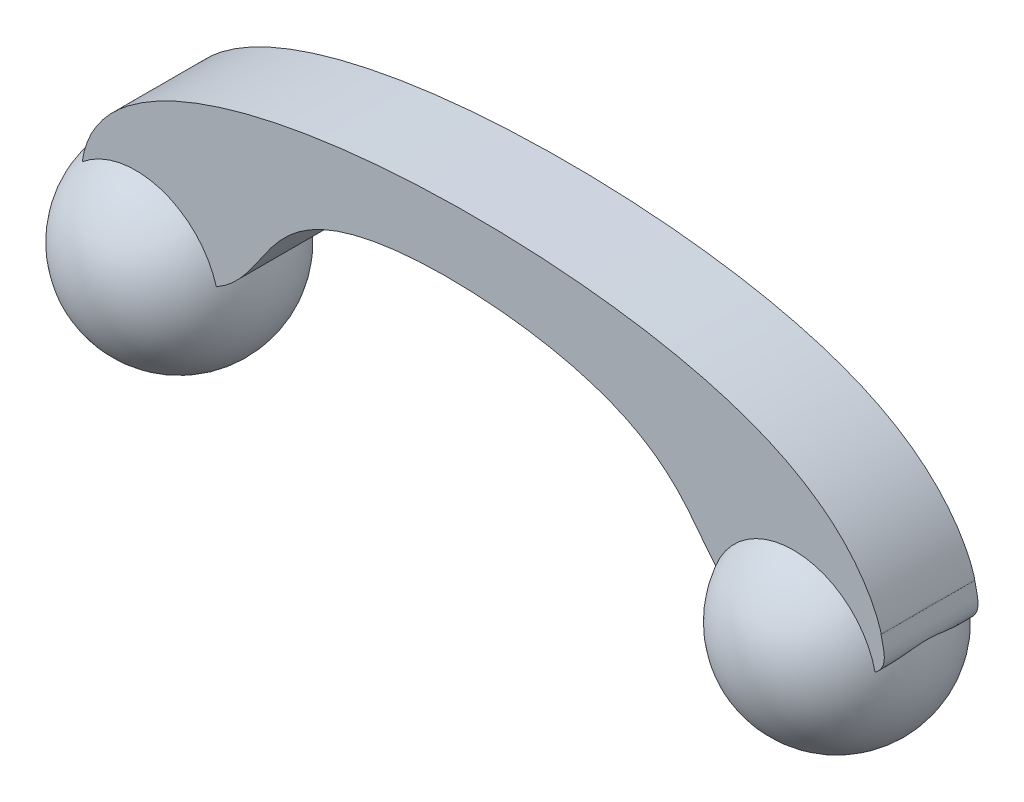
ISO-10303-21;
HEADER;
FILE_DESCRIPTION(('STEP AP214'),'2;1');
FILE_NAME('part.step','',(''),(''),'','','');
FILE_SCHEMA(('AUTOMOTIVE_DESIGN { 1 0 10303 214 1 1 1 1 }'));
ENDSEC;
DATA;
#1=APPLICATION_CONTEXT('core data for automotive mechanical design processes');
#2=APPLICATION_PROTOCOL_DEFINITION('international standard','automotive_design',2000,#1);
#3=PRODUCT_CONTEXT('',#1,'mechanical');
#4=PRODUCT('Part','Part','',(#3));
#5=PRODUCT_RELATED_PRODUCT_CATEGORY('part','',(#4));
#6=PRODUCT_DEFINITION_FORMATION('','',#4);
#7=PRODUCT_DEFINITION_CONTEXT('part definition',#1,'design');
#8=PRODUCT_DEFINITION('design','',#6,#7);
#9=PRODUCT_DEFINITION_SHAPE('','',#8);
#10=(LENGTH_UNIT() NAMED_UNIT(*) SI_UNIT(.MILLI.,.METRE.));
#11=(NAMED_UNIT(*) PLANE_ANGLE_UNIT() SI_UNIT($,.RADIAN.));
#12=(NAMED_UNIT(*) SI_UNIT($,.STERADIAN.) SOLID_ANGLE_UNIT());
#13=UNCERTAINTY_MEASURE_WITH_UNIT(LENGTH_MEASURE(1.E-05),#10,'distance_accuracy_value','');
#14=(GEOMETRIC_REPRESENTATION_CONTEXT(3) GLOBAL_UNCERTAINTY_ASSIGNED_CONTEXT((#13)) GLOBAL_UNIT_ASSIGNED_CONTEXT((#10,
#11,#12)) REPRESENTATION_CONTEXT('',''));
#15=CARTESIAN_POINT('',(0.,0.,0.));
#16=DIRECTION('',(0.,0.,1.));
#17=DIRECTION('',(1.,0.,0.));
#18=AXIS2_PLACEMENT_3D('',#15,#16,#17);
#19=CARTESIAN_POINT('',(-81.62925333054,0.,20.));
#20=CARTESIAN_POINT('',(-83.3967289414946,-13.8452256191448,20.));
#21=CARTESIAN_POINT('',(-61.221939997905,-15.9253333016357,20.));
#22=CARTESIAN_POINT('',(-49.5878641727579,-13.4459400929978,20.));
#23=CARTESIAN_POINT('',(-35.474395138973,-11.3479919933812,20.));
#24=CARTESIAN_POINT('',(-35.474395138973,2.5747544858932,20.));
#25=CARTESIAN_POINT('',(-37.5723432385897,13.6366626475084,20.));
#26=CARTESIAN_POINT('',(-90.5932133925385,42.6264909331208,20.));
#27=CARTESIAN_POINT('',(6.86601196238187,15.3531656381039,20.));
#28=CARTESIAN_POINT('',(21.5516486596987,15.3531656381039,20.));
#29=CARTESIAN_POINT('',(23.6495967593153,18.0232814012524,20.));
#30=CARTESIAN_POINT('',(59.6961595618201,30.6109699989525,20.));
#31=CARTESIAN_POINT('',(54.3559280355231,3.71908981295684,20.));
#32=CARTESIAN_POINT('',(59.6961595618201,-5.05414769453111,20.));
#33=CARTESIAN_POINT('',(52.2579799359064,-14.0181077565297,20.));
#34=CARTESIAN_POINT('',(13.3505788157425,-27.1779640177616,20.));
#35=CARTESIAN_POINT('',(84.6808142027097,-13.6366626475084,20.));
#36=CARTESIAN_POINT('',(87.9230976293901,-13.6366626475084,20.));
#37=CARTESIAN_POINT('',(91.1653810560704,-12.1108822114236,20.));
#38=CARTESIAN_POINT('',(91.1653810560704,-9.44076644827507,20.));
#39=CARTESIAN_POINT('',(89.0674329564537,-3.52836725844624,20.));
#40=CARTESIAN_POINT('',(88.8767104019431,-2.00258682236139,20.));
#41=B_SPLINE_CURVE_WITH_KNOTS('',21,(#19,#20,#21,#22,#23,#24,#25,#26,#27,#28,#29,#30,#31,#32,
#33,#34,#35,#36,#37,#38,#39,#40),.UNSPECIFIED.,.F.,.F.,(22,22),(0.,1.),.UNSPECIFIED.);
#42=DIRECTION('',(0.,0.,-1.));
#43=VECTOR('',#42,1.);
#44=SURFACE_OF_LINEAR_EXTRUSION('',#41,#43);
#45=CARTESIAN_POINT('',(-53.7263552662011,-9.0962425035575,0.));
#46=CARTESIAN_POINT('',(-53.5476289608169,-9.00462372453353,0.313394893814392));
#47=CARTESIAN_POINT('',(-53.377769210423,-8.91408495553011,0.632153101416802));
#48=CARTESIAN_POINT('',(-53.055775573976,-8.73679618468713,1.27956575111107));
#49=CARTESIAN_POINT('',(-52.9036434106797,-8.65004655158494,1.60822115110754));
#50=CARTESIAN_POINT('',(-52.6171262572083,-8.48197961610113,2.27455091661191));
#51=CARTESIAN_POINT('',(-52.4827420300889,-8.40066254736167,2.61222566914838));
#52=CARTESIAN_POINT('',(-52.2316065044136,-8.2449579656106,3.29590864428812));
#53=CARTESIAN_POINT('',(-52.1148672633518,-8.17057520425917,3.64192237970383));
#54=CARTESIAN_POINT('',(-51.8990892661429,-8.0302452632447,4.34108333135716));
#55=CARTESIAN_POINT('',(-51.8000493597978,-7.96429753550697,4.69423008239173));
#56=CARTESIAN_POINT('',(-51.6196081044879,-7.84212420379973,5.4066551077774));
#57=CARTESIAN_POINT('',(-51.5382064310637,-7.78589842099657,5.76593326920857));
#58=CARTESIAN_POINT('',(-51.392861783448,-7.68419181272662,6.49017867371506));
#59=CARTESIAN_POINT('',(-51.3289496477927,-7.63872998564694,6.85515478151343));
#60=CARTESIAN_POINT('',(-51.218728811018,-7.55958862634824,7.58904014770847));
#61=CARTESIAN_POINT('',(-51.172420813032,-7.52590956475327,7.95794956260195));
#62=CARTESIAN_POINT('',(-51.0973806044885,-7.47101678254523,8.69847916610874));
#63=CARTESIAN_POINT('',(-51.0686485083896,-7.44980314311008,9.07009937235946));
#64=CARTESIAN_POINT('',(-51.028754217793,-7.4202816657393,9.81454649605831));
#65=CARTESIAN_POINT('',(-51.0175804485305,-7.41196532571932,10.1873724560564));
#66=CARTESIAN_POINT('',(-51.0127598933135,-7.40838274718621,10.9332032421124));
#67=CARTESIAN_POINT('',(-51.0191129705515,-7.41311640681001,11.3062080667514));
#68=CARTESIAN_POINT('',(-51.0493455980868,-7.43552930609273,12.0510629979309));
#69=CARTESIAN_POINT('',(-51.0732236718583,-7.45320745514505,12.422913199101));
#70=CARTESIAN_POINT('',(-51.1532297505971,-7.51197027674162,13.3311782955768));
#71=CARTESIAN_POINT('',(-51.2190358162162,-7.5600086877726,13.8663333795222));
#72=CARTESIAN_POINT('',(-51.3876489528189,-7.6805943558271,14.9279976164206));
#73=CARTESIAN_POINT('',(-51.490460888081,-7.75314483479021,15.4545056232308));
#74=CARTESIAN_POINT('',(-51.7330757273395,-7.91960310307996,16.4947961346253));
#75=CARTESIAN_POINT('',(-51.87283565328,-8.01348606066676,17.008592670749));
#76=CARTESIAN_POINT('',(-52.1895216440249,-8.2187599005225,18.0207670892066));
#77=CARTESIAN_POINT('',(-52.3664275639943,-8.33014128491902,18.5191531614782));
#78=CARTESIAN_POINT('',(-52.6289024613263,-8.48836860958659,19.1759479323441));
#79=CARTESIAN_POINT('',(-52.6980546111559,-8.52949960200471,19.342451223435));
#80=CARTESIAN_POINT('',(-52.8406449197818,-8.61303747572806,19.6730164356026));
#81=CARTESIAN_POINT('',(-52.914077358859,-8.65544261925381,19.8370812630203));
#82=CARTESIAN_POINT('',(-52.9897008912071,-8.69841717998982,20.));
#83=B_SPLINE_CURVE_WITH_KNOTS('',3,(#45,#46,#47,#48,#49,#50,#51,#52,#53,#54,#55,#56,#57,#58,#59,
#60,#61,#62,#63,#64,#65,#66,#67,#68,#69,#70,#71,#72,#73,#74,#75,#76,#77,#78,#79,#80,#81,#82),
.UNSPECIFIED.,.F.,.F.,(4,2,2,2,2,2,2,2,2,2,2,2,2,2,2,2,2,2,4),(0.,1.11652823374394,
2.23316488074806,3.3498495208641,4.46729381762675,5.58466547041152,6.70201656713128,
7.82132532797799,8.94067879085188,10.0600395431518,11.1786620826914,12.297275890737,
13.4157954635278,15.0377425822736,16.6599029776,18.2801847087055,19.8995899955304,
20.4543127292331,21.0083104680987),.UNSPECIFIED.);
#84=CARTESIAN_POINT('',(-53.726355266201,-9.09624250355747,0.));
#85=VERTEX_POINT('',#84);
#86=CARTESIAN_POINT('',(-52.9897008912071,-8.69841717998978,20.));
#87=VERTEX_POINT('',#86);
#88=EDGE_CURVE('E101',#85,#87,#83,.T.);
#89=ORIENTED_EDGE('',*,*,#88,.F.);
#90=CARTESIAN_POINT('',(-81.62925333054,0.,0.));
#91=CARTESIAN_POINT('',(-83.3967289414946,-13.8452256191448,0.));
#92=CARTESIAN_POINT('',(-61.221939997905,-15.9253333016357,0.));
#93=CARTESIAN_POINT('',(-49.5878641727579,-13.4459400929978,0.));
#94=CARTESIAN_POINT('',(-35.474395138973,-11.3479919933812,0.));
#95=CARTESIAN_POINT('',(-35.474395138973,2.5747544858932,0.));
#96=CARTESIAN_POINT('',(-37.5723432385897,13.6366626475084,0.));
#97=CARTESIAN_POINT('',(-90.5932133925385,42.6264909331208,0.));
#98=CARTESIAN_POINT('',(6.86601196238187,15.3531656381039,0.));
#99=CARTESIAN_POINT('',(21.5516486596987,15.3531656381039,0.));
#100=CARTESIAN_POINT('',(23.6495967593153,18.0232814012524,0.));
#101=CARTESIAN_POINT('',(59.6961595618201,30.6109699989525,0.));
#102=CARTESIAN_POINT('',(54.3559280355231,3.71908981295684,0.));
#103=CARTESIAN_POINT('',(59.6961595618201,-5.05414769453111,0.));
#104=CARTESIAN_POINT('',(52.2579799359064,-14.0181077565297,0.));
#105=CARTESIAN_POINT('',(13.3505788157425,-27.1779640177616,0.));
#106=CARTESIAN_POINT('',(84.6808142027097,-13.6366626475084,0.));
#107=CARTESIAN_POINT('',(87.9230976293901,-13.6366626475084,0.));
#108=CARTESIAN_POINT('',(91.1653810560704,-12.1108822114236,0.));
#109=CARTESIAN_POINT('',(91.1653810560704,-9.44076644827507,0.));
#110=CARTESIAN_POINT('',(89.0674329564537,-3.52836725844624,0.));
#111=CARTESIAN_POINT('',(88.8767104019431,-2.00258682236139,0.));
#112=B_SPLINE_CURVE_WITH_KNOTS('',21,(#90,#91,#92,#93,#94,#95,#96,#97,#98,#99,#100,#101,#102,
#103,#104,#105,#106,#107,#108,#109,#110,#111),.UNSPECIFIED.,.F.,.F.,(22,22),(0.,1.),.UNSPECIFIED.);
#113=CARTESIAN_POINT('',(54.2028493430971,-7.63417032790614,0.));
#114=VERTEX_POINT('',#113);
#115=EDGE_CURVE('E88',#85,#114,#112,.T.);
#116=ORIENTED_EDGE('',*,*,#115,.T.);
#117=CARTESIAN_POINT('',(53.5856071759249,-6.96784430969093,20.));
#118=CARTESIAN_POINT('',(53.469634069677,-6.83849519176025,19.6996840338178));
#119=CARTESIAN_POINT('',(53.3600104723952,-6.71407446846438,19.3947754285229));
#120=CARTESIAN_POINT('',(53.1532819946661,-6.47624851917929,18.7764213005906));
#121=CARTESIAN_POINT('',(53.0561809071532,-6.36284663323062,18.4629732260972));
#122=CARTESIAN_POINT('',(52.8743804544795,-6.14828889170922,17.8283478628862));
#123=CARTESIAN_POINT('',(52.7896819908834,-6.04713392647539,17.507170014254));
#124=CARTESIAN_POINT('',(52.6325928207296,-5.85798498232312,16.8578314367759));
#125=CARTESIAN_POINT('',(52.5602077423424,-5.76999702394498,16.5296675914819));
#126=CARTESIAN_POINT('',(52.4277743490811,-5.60802792304518,15.8674762245094));
#127=CARTESIAN_POINT('',(52.3677246866703,-5.53404525063731,15.5334493476479));
#128=CARTESIAN_POINT('',(52.2599653445089,-5.40068886960523,14.8605590544671));
#129=CARTESIAN_POINT('',(52.2122551553056,-5.34131455785887,14.5216958384327));
#130=CARTESIAN_POINT('',(52.1083078357864,-5.21156939029736,13.6687592535549));
#131=CARTESIAN_POINT('',(52.0598412757727,-5.15067532655809,13.1522424185266));
#132=CARTESIAN_POINT('',(51.990931129746,-5.06396031806925,12.1144297004487));
#133=CARTESIAN_POINT('',(51.9704892077678,-5.03814145600059,11.5931335354641));
#134=CARTESIAN_POINT('',(51.9576841216393,-5.02197736865793,10.5500445106974));
#135=CARTESIAN_POINT('',(51.965298910047,-5.03160428947832,10.0282523629106));
#136=CARTESIAN_POINT('',(52.0085387691476,-5.08612467034137,8.98771269870832));
#137=CARTESIAN_POINT('',(52.0441622331853,-5.13101610751357,8.46896500937373));
#138=CARTESIAN_POINT('',(52.1421386841587,-5.25384814652041,7.45072436520295));
#139=CARTESIAN_POINT('',(52.2038289105206,-5.33096880369886,6.95106824122812));
#140=CARTESIAN_POINT('',(52.3537196064122,-5.51686872097886,5.96169274380444));
#141=CARTESIAN_POINT('',(52.4419219286569,-5.62565019358059,5.47197406735702));
#142=CARTESIAN_POINT('',(52.6447910658831,-5.87291935296721,4.50580134392724));
#143=CARTESIAN_POINT('',(52.7594537698266,-6.01140242490395,4.02934524926628));
#144=CARTESIAN_POINT('',(53.0153466465169,-6.31532416607947,3.09263681253161));
#145=CARTESIAN_POINT('',(53.156567980349,-6.48075386483018,2.63237913982483));
#146=CARTESIAN_POINT('',(53.4408613519539,-6.80620455948879,1.80364572121603));
#147=CARTESIAN_POINT('',(53.5799042045542,-6.96273678034986,1.43240826817201));
#148=CARTESIAN_POINT('',(53.802787410223,-7.20763291645802,0.886628491250263));
#149=CARTESIAN_POINT('',(53.8793673037987,-7.29084146956109,0.706758342126987));
#150=CARTESIAN_POINT('',(54.0374189332409,-7.46030917060489,0.350639588295184));
#151=CARTESIAN_POINT('',(54.118890686266,-7.54656832924551,0.17439099629256));
#152=CARTESIAN_POINT('',(54.2028493430971,-7.63417032790615,0.));
#153=B_SPLINE_CURVE_WITH_KNOTS('',3,(#117,#118,#119,#120,#121,#122,#123,#124,#125,#126,#127,
#128,#129,#130,#131,#132,#133,#134,#135,#136,#137,#138,#139,#140,#141,#142,#143,#144,#145,#146,
#147,#148,#149,#150,#151,#152),.UNSPECIFIED.,.F.,.F.,(4,2,2,2,2,2,2,2,2,2,2,2,2,2,2,2,2,4),(0.,
1.04073486341316,2.08178421762401,3.12290920969494,4.16450880525206,5.20599455454146,
6.24743729773478,7.81242257552839,9.37750077431353,10.9413493703196,12.505108266183,
14.0312966504442,15.5575917124115,17.0836497998021,18.6092008993202,19.8868716743362,
20.5241710114378,21.1614725840642),.UNSPECIFIED.);
#154=CARTESIAN_POINT('',(53.5856071759249,-6.96784430969092,20.));
#155=VERTEX_POINT('',#154);
#156=EDGE_CURVE('E143',#155,#114,#153,.T.);
#157=ORIENTED_EDGE('',*,*,#156,.F.);
#158=EDGE_CURVE('E102',#87,#155,#41,.T.);
#159=ORIENTED_EDGE('',*,*,#158,.F.);
#160=EDGE_LOOP('',(#89,#116,#157,#159));
#161=FACE_BOUND('',#160,.T.);
#162=ADVANCED_FACE('F33',(#161),#44,.F.);
#163=CARTESIAN_POINT('',(-81.62925333054,0.,1.287130996694));
#164=CARTESIAN_POINT('',(-81.6364493118751,-0.0563670296021964,1.21425267278646));
#165=CARTESIAN_POINT('',(-81.6431606208709,-0.113102624184991,1.14161117110302));
#166=CARTESIAN_POINT('',(-81.6555516290833,-0.227244830745067,0.996820014760496));
#167=CARTESIAN_POINT('',(-81.6612317739163,-0.284651141402734,0.924670160672648));
#168=CARTESIAN_POINT('',(-81.6715033712094,-0.400104593168121,0.780833557534377));
#169=CARTESIAN_POINT('',(-81.6760950681627,-0.458151587290214,0.709146708007301));
#170=CARTESIAN_POINT('',(-81.6841334415156,-0.574858086309905,0.566207268343977));
#171=CARTESIAN_POINT('',(-81.687580105267,-0.633517597966055,0.494954683013191));
#172=CARTESIAN_POINT('',(-81.6932720021528,-0.751419173237653,0.352858806150764));
#173=CARTESIAN_POINT('',(-81.6955169782172,-0.81066135874298,0.28201560540018));
#174=CARTESIAN_POINT('',(-81.6987499028753,-0.929700100262917,0.140713552308141));
#175=CARTESIAN_POINT('',(-81.699737288932,-0.989496892322533,0.070254885995635));
#176=CARTESIAN_POINT('',(-81.700067601925,-1.04953655837465,0.));
#177=B_SPLINE_CURVE_WITH_KNOTS('',3,(#163,#164,#165,#166,#167,#168,#169,#170,#171,#172,#173,
#174,#175,#176),.UNSPECIFIED.,.F.,.F.,(4,2,2,2,2,2,4),(0.,0.277238959804898,0.554357824408045,
0.831414381919361,1.10847399972493,1.3855928636224,1.66283564304421),.UNSPECIFIED.);
#178=CARTESIAN_POINT('',(-81.62925333054,0.,1.287130996694));
#179=VERTEX_POINT('',#178);
#180=CARTESIAN_POINT('',(-81.700067601925,-1.04953655837471,0.));
#181=VERTEX_POINT('',#180);
#182=EDGE_CURVE('E50',#179,#181,#177,.T.);
#183=ORIENTED_EDGE('',*,*,#182,.F.);
#184=DIRECTION('',(0.,0.,-1.));
#185=VECTOR('',#184,1.);
#186=CARTESIAN_POINT('',(-81.62925333054,0.,20.));
#187=LINE('',#186,#185);
#188=CARTESIAN_POINT('',(-81.62925333054,0.,0.));
#189=VERTEX_POINT('',#188);
#190=EDGE_CURVE('E176',#179,#189,#187,.T.);
#191=ORIENTED_EDGE('',*,*,#190,.T.);
#192=EDGE_CURVE('E96',#189,#181,#112,.T.);
#193=ORIENTED_EDGE('',*,*,#192,.T.);
#194=EDGE_LOOP('',(#183,#191,#193));
#195=FACE_BOUND('',#194,.T.);
#196=ADVANCED_FACE('F193',(#195),#44,.F.);
#197=CARTESIAN_POINT('',(-81.62925333054,0.,20.));
#198=CARTESIAN_POINT('',(-78.7684150128809,22.4099001549964,20.));
#199=CARTESIAN_POINT('',(-45.5826905280352,37.8584270703556,20.));
#200=CARTESIAN_POINT('',(9.726850280041,37.8584270703556,20.));
#201=CARTESIAN_POINT('',(57.4074889076928,30.9924151079737,20.));
#202=CARTESIAN_POINT('',(68.6601196238187,26.9872414632509,20.));
#203=CARTESIAN_POINT('',(85.0622593117309,15.7346107471251,20.));
#204=CARTESIAN_POINT('',(89.0674329564537,-1.81186426785078,20.));
#205=CARTESIAN_POINT('',(88.8767104019431,-2.00258682236139,20.));
#206=B_SPLINE_CURVE_WITH_KNOTS('',8,(#197,#198,#199,#200,#201,#202,#203,#204,#205),
.UNSPECIFIED.,.F.,.F.,(9,9),(0.,1.),.UNSPECIFIED.);
#207=DIRECTION('',(0.,0.,-1.));
#208=VECTOR('',#207,1.);
#209=SURFACE_OF_LINEAR_EXTRUSION('',#206,#208);
#210=ORIENTED_EDGE('',*,*,#190,.F.);
#211=CARTESIAN_POINT('',(-81.62925333054,0.,1.287130996694));
#212=CARTESIAN_POINT('',(-81.6070223154293,0.174217880999733,1.51238290936692));
#213=CARTESIAN_POINT('',(-81.5829221301639,0.343532086148693,1.74126752491105));
#214=CARTESIAN_POINT('',(-81.5318959446768,0.671713223623589,2.20643604405884));
#215=CARTESIAN_POINT('',(-81.5049672117157,0.83056980704181,2.44272694558641));
#216=CARTESIAN_POINT('',(-81.4492349995095,1.13689942479684,2.92247516651305));
#217=CARTESIAN_POINT('',(-81.4204309527418,1.28436898330708,3.16593464300058));
#218=CARTESIAN_POINT('',(-81.3616482752989,1.56852983693628,3.66241275422948));
#219=CARTESIAN_POINT('',(-81.3316604202883,1.70509006178039,3.91550544023556));
#220=CARTESIAN_POINT('',(-81.2718750042721,1.96474157920912,4.42845626400614));
#221=CARTESIAN_POINT('',(-81.2420773941242,2.08783649452887,4.68831255866872));
#222=CARTESIAN_POINT('',(-81.1837419783671,2.31969109495482,5.21448278227997));
#223=CARTESIAN_POINT('',(-81.1552041207869,2.42845137180302,5.48079644412718));
#224=CARTESIAN_POINT('',(-81.1002511764019,2.63146579913568,6.02130273307617));
#225=CARTESIAN_POINT('',(-81.073852572297,2.72561164854338,6.29553783124467));
#226=CARTESIAN_POINT('',(-81.024428580845,2.8975976300289,6.84941623564626));
#227=CARTESIAN_POINT('',(-81.0014035120527,2.9754362225495,7.12906004979271));
#228=CARTESIAN_POINT('',(-80.9596549645693,3.1140019284154,7.69288995004339));
#229=CARTESIAN_POINT('',(-80.9409315348971,3.17472884676812,7.97707608786975));
#230=CARTESIAN_POINT('',(-80.9086624923935,3.27807933381464,8.54721782195927));
#231=CARTESIAN_POINT('',(-80.8950858628872,3.3208115247445,8.83315191359724));
#232=CARTESIAN_POINT('',(-80.8735215296445,3.38820808515582,9.40736379094837));
#233=CARTESIAN_POINT('',(-80.8655338342639,3.41287242762466,9.69564158016484));
#234=CARTESIAN_POINT('',(-80.8554873411227,3.44383399601045,10.2732190820583));
#235=CARTESIAN_POINT('',(-80.8534274445625,3.45013462589853,10.5625185953889));
#236=CARTESIAN_POINT('',(-80.8556494222692,3.44332425464167,11.2359995379));
#237=CARTESIAN_POINT('',(-80.8622373357558,3.42315515024412,11.6201247835013));
#238=CARTESIAN_POINT('',(-80.8855692737159,3.35067396402605,12.3849474550041));
#239=CARTESIAN_POINT('',(-80.9023126990678,3.29836377835706,12.7656450817726));
#240=CARTESIAN_POINT('',(-80.9448128705967,3.16234748089727,13.5228875199754));
#241=CARTESIAN_POINT('',(-80.9706158282004,3.07848024062402,13.8994006307208));
#242=CARTESIAN_POINT('',(-81.0293485618194,2.88098870723749,14.6439536022415));
#243=CARTESIAN_POINT('',(-81.0622785484244,2.76736353481546,15.0119932122862));
#244=CARTESIAN_POINT('',(-81.1247820614385,2.54186813498418,15.6537348378747));
#245=CARTESIAN_POINT('',(-81.1533682116797,2.43567937543594,15.9295544648912));
#246=CARTESIAN_POINT('',(-81.212265859912,2.20782735928886,16.4746028601664));
#247=CARTESIAN_POINT('',(-81.2425777096583,2.08616094154147,16.7438302686013));
#248=CARTESIAN_POINT('',(-81.3037681868996,1.82830420949813,17.2752817085849));
#249=CARTESIAN_POINT('',(-81.3346470287708,1.69210830401736,17.5375029951727));
#250=CARTESIAN_POINT('',(-81.3955286272058,1.40746594039961,18.0522514388022));
#251=CARTESIAN_POINT('',(-81.425536710409,1.25913820262823,18.3048437253454));
#252=CARTESIAN_POINT('',(-81.483839668852,0.950198804650387,18.8024433818916));
#253=CARTESIAN_POINT('',(-81.5121352504134,0.78959227155449,19.0474538583535));
#254=CARTESIAN_POINT('',(-81.5659541528162,0.457132602174179,19.5295837312267));
#255=CARTESIAN_POINT('',(-81.5914809019825,0.285293806184723,19.7667126280858));
#256=CARTESIAN_POINT('',(-81.6151243411527,0.108181645448751,20.));
#257=B_SPLINE_CURVE_WITH_KNOTS('',3,(#211,#212,#213,#214,#215,#216,#217,#218,#219,#220,#221,
#222,#223,#224,#225,#226,#227,#228,#229,#230,#231,#232,#233,#234,#235,#236,#237,#238,#239,#240,
#241,#242,#243,#244,#245,#246,#247,#248,#249,#250,#251,#252,#253,#254,#255,#256),.UNSPECIFIED.,
.F.,.F.,(4,2,2,2,2,2,2,2,2,2,2,2,2,2,2,2,2,2,2,2,2,2,4),(0.,0.856848392526042,1.71453236030208,
2.57247710485333,3.43953154817476,4.30635214061859,5.17313693900135,6.04606645673406,
6.91907835005796,7.79210019120792,8.65977389712368,9.52744890026648,10.3949630574728,
11.5475096632894,12.6999882815609,13.85843304839,15.0169120496396,15.9072416874889,
16.7977534586047,17.6886091578672,18.5716029208609,19.4542299754855,20.335751390311),.UNSPECIFIED.);
#258=CARTESIAN_POINT('',(-81.6151243411527,0.108181645448733,20.));
#259=VERTEX_POINT('',#258);
#260=EDGE_CURVE('E57',#179,#259,#257,.T.);
#261=ORIENTED_EDGE('',*,*,#260,.T.);
#262=CARTESIAN_POINT('',(88.8767104019431,-2.00258682236139,20.));
#263=VERTEX_POINT('',#262);
#264=EDGE_CURVE('E151',#259,#263,#206,.T.);
#265=ORIENTED_EDGE('',*,*,#264,.T.);
#266=DIRECTION('',(0.,0.,-1.));
#267=VECTOR('',#266,1.);
#268=CARTESIAN_POINT('',(88.8767104019431,-2.00258682236139,20.));
#269=LINE('',#268,#267);
#270=CARTESIAN_POINT('',(88.8767104019431,-2.00258682236139,0.));
#271=VERTEX_POINT('',#270);
#272=EDGE_CURVE('E163',#263,#271,#269,.T.);
#273=ORIENTED_EDGE('',*,*,#272,.T.);
#274=CARTESIAN_POINT('',(-81.62925333054,0.,0.));
#275=CARTESIAN_POINT('',(-78.7684150128809,22.4099001549964,0.));
#276=CARTESIAN_POINT('',(-45.5826905280352,37.8584270703556,0.));
#277=CARTESIAN_POINT('',(9.726850280041,37.8584270703556,0.));
#278=CARTESIAN_POINT('',(57.4074889076928,30.9924151079737,0.));
#279=CARTESIAN_POINT('',(68.6601196238187,26.9872414632509,0.));
#280=CARTESIAN_POINT('',(85.0622593117309,15.7346107471251,0.));
#281=CARTESIAN_POINT('',(89.0674329564537,-1.81186426785078,0.));
#282=CARTESIAN_POINT('',(88.8767104019431,-2.00258682236139,0.));
#283=B_SPLINE_CURVE_WITH_KNOTS('',8,(#274,#275,#276,#277,#278,#279,#280,#281,#282),
.UNSPECIFIED.,.F.,.F.,(9,9),(0.,1.),.UNSPECIFIED.);
#284=EDGE_CURVE('E150',#189,#271,#283,.T.);
#285=ORIENTED_EDGE('',*,*,#284,.F.);
#286=EDGE_LOOP('',(#210,#261,#265,#273,#285));
#287=FACE_BOUND('',#286,.T.);
#288=ADVANCED_FACE('F35',(#287),#209,.T.);
#289=CARTESIAN_POINT('',(86.8855693079469,-10.1269142874137,0.));
#290=CARTESIAN_POINT('',(87.0126843885355,-10.0494178192095,0.22366990009913));
#291=CARTESIAN_POINT('',(87.1348064089845,-9.97118048508058,0.44991776421739));
#292=CARTESIAN_POINT('',(87.3688589957721,-9.8135450509259,0.907089017885035));
#293=CARTESIAN_POINT('',(87.4807941287531,-9.73414748972506,1.13801025510744));
#294=CARTESIAN_POINT('',(87.6943576082527,-9.57446077431987,1.60419591774061));
#295=CARTESIAN_POINT('',(87.7959883428283,-9.49417183150181,1.83945932184087));
#296=CARTESIAN_POINT('',(87.9888839507518,-9.3330988916756,2.31401522738299));
#297=CARTESIAN_POINT('',(88.0801493208668,-9.25231491858784,2.55330753510524));
#298=CARTESIAN_POINT('',(88.2537796308499,-9.08941052530465,3.03974511786982));
#299=CARTESIAN_POINT('',(88.3359651736283,-9.00729093487876,3.28695469264639));
#300=CARTESIAN_POINT('',(88.4896828291429,-8.84387525590315,3.784945633061));
#301=CARTESIAN_POINT('',(88.5612143944113,-8.76257920987219,4.03572718152426));
#302=CARTESIAN_POINT('',(88.6938134550283,-8.60185346010947,4.54063364020589));
#303=CARTESIAN_POINT('',(88.7548808340851,-8.52242377712763,4.79475858754667));
#304=CARTESIAN_POINT('',(88.8668757527102,-8.36679720613511,5.30619626324731));
#305=CARTESIAN_POINT('',(88.9178039790847,-8.29060009943139,5.5635087744328));
#306=CARTESIAN_POINT('',(88.9990093172871,-8.1607655609509,6.01952579175075));
#307=CARTESIAN_POINT('',(89.0313148285727,-8.10608183104483,6.21757215781016));
#308=CARTESIAN_POINT('',(89.0905994785256,-8.00053719266236,6.61546652984227));
#309=CARTESIAN_POINT('',(89.11757841044,-7.94967643262312,6.81531460543416));
#310=CARTESIAN_POINT('',(89.1909828330991,-7.80440623165456,7.41754306006571));
#311=CARTESIAN_POINT('',(89.2298954240906,-7.71727604701453,7.82271890396228));
#312=CARTESIAN_POINT('',(89.2751249636697,-7.60863962866478,8.43296313435817));
#313=CARTESIAN_POINT('',(89.287975866251,-7.57622421659833,8.63565739616733));
#314=CARTESIAN_POINT('',(89.3097784243538,-7.51954520580062,9.04241105912454));
#315=CARTESIAN_POINT('',(89.3187301323002,-7.49528149747029,9.24647044188101));
#316=CARTESIAN_POINT('',(89.332996646109,-7.45584059279811,9.65550584648832));
#317=CARTESIAN_POINT('',(89.3383130870318,-7.44065931177179,9.86048141444852));
#318=CARTESIAN_POINT('',(89.3454967598282,-7.41999489471084,10.2709853177282));
#319=CARTESIAN_POINT('',(89.3473640304841,-7.4145116496322,10.4765136468064));
#320=CARTESIAN_POINT('',(89.3477182668513,-7.41347797489266,10.8889066669706));
#321=CARTESIAN_POINT('',(89.3461836497901,-7.41799096471727,11.0957715405868));
#322=CARTESIAN_POINT('',(89.3396334477768,-7.43688145298814,11.5089914941636));
#323=CARTESIAN_POINT('',(89.3346178159598,-7.451259084242,11.7153465672232));
#324=CARTESIAN_POINT('',(89.3209273816581,-7.48928166375316,12.1271743202616));
#325=CARTESIAN_POINT('',(89.3122507956107,-7.51293112871222,12.3326465207627));
#326=CARTESIAN_POINT('',(89.2909740185229,-7.56857430489721,12.7422327857197));
#327=CARTESIAN_POINT('',(89.2783737741107,-7.60056812962651,12.9463468316628));
#328=CARTESIAN_POINT('',(89.2338891137618,-7.70813711285999,13.5604782726642));
#329=CARTESIAN_POINT('',(89.1954453065997,-7.79487490686359,13.9681184973488));
#330=CARTESIAN_POINT('',(89.1226517492247,-7.93993687338872,14.5739555860858));
#331=CARTESIAN_POINT('',(89.0958634487699,-7.9907876080177,14.7749783456624));
#332=CARTESIAN_POINT('',(89.0369215592735,-8.09641440631638,15.175203941764));
#333=CARTESIAN_POINT('',(89.0047681844174,-8.15119031323486,15.3744068506068));
#334=CARTESIAN_POINT('',(88.9243005275606,-8.28062520657183,15.8305925481729));
#335=CARTESIAN_POINT('',(88.8740338463611,-8.35631073956347,16.0869404241483));
#336=CARTESIAN_POINT('',(88.7634782393321,-8.51094527069387,16.5964340007178));
#337=CARTESIAN_POINT('',(88.7031904715721,-8.58989389094846,16.84958006769));
#338=CARTESIAN_POINT('',(88.5722621558496,-8.74969589594842,17.3525492957036));
#339=CARTESIAN_POINT('',(88.5016224943546,-8.83054911709937,17.6023727392764));
#340=CARTESIAN_POINT('',(88.3509317726357,-8.99190603149919,18.0947759727411));
#341=CARTESIAN_POINT('',(88.2710381504411,-9.07239670843989,18.3374081987797));
#342=CARTESIAN_POINT('',(88.100920116119,-9.23347793984124,18.8190239002883));
#343=CARTESIAN_POINT('',(88.0106946284293,-9.31406850383488,19.0580069929381));
#344=CARTESIAN_POINT('',(87.8199141399509,-9.4748389690182,19.5320483787274));
#345=CARTESIAN_POINT('',(87.71935594017,-9.55501873491041,19.7671054300269));
#346=CARTESIAN_POINT('',(87.6136566964828,-9.63471674590085,20.));
#347=B_SPLINE_CURVE_WITH_KNOTS('',3,(#289,#290,#291,#292,#293,#294,#295,#296,#297,#298,#299,
#300,#301,#302,#303,#304,#305,#306,#307,#308,#309,#310,#311,#312,#313,#314,#315,#316,#317,#318,
#319,#320,#321,#322,#323,#324,#325,#326,#327,#328,#329,#330,#331,#332,#333,#334,#335,#336,#337,
#338,#339,#340,#341,#342,#343,#344,#345,#346),.UNSPECIFIED.,.F.,.F.,(4,2,2,2,2,2,2,2,2,2,2,2,2,
2,2,2,2,2,2,2,2,2,2,2,2,2,2,2,4),(0.,0.805994838139786,1.6116265614473,2.4170711497892,
3.22247712034536,4.04168987912388,4.8609447196351,5.68020866418273,6.49941709450575,
7.12324898085111,7.74710507665898,8.99446509614678,9.6113217779739,10.2281701658758,
10.8447409265806,11.4613047545647,12.0817914685451,12.7022865362971,13.3230842497357,
13.9438904079578,15.1980318851679,15.8251929429625,16.4523289691078,17.2680174726522,
18.0836117780238,18.899136282091,19.7024015338335,20.5057504827949,21.3093489010827),.UNSPECIFIED.);
#348=CARTESIAN_POINT('',(86.8855693079469,-10.1269142874137,0.));
#349=VERTEX_POINT('',#348);
#350=CARTESIAN_POINT('',(87.6136566964828,-9.63471674590085,20.));
#351=VERTEX_POINT('',#350);
#352=EDGE_CURVE('E136',#349,#351,#347,.T.);
#353=ORIENTED_EDGE('',*,*,#352,.F.);
#354=EDGE_CURVE('E97',#349,#271,#112,.T.);
#355=ORIENTED_EDGE('',*,*,#354,.T.);
#356=ORIENTED_EDGE('',*,*,#272,.F.);
#357=EDGE_CURVE('E155',#351,#263,#41,.T.);
#358=ORIENTED_EDGE('',*,*,#357,.F.);
#359=EDGE_LOOP('',(#353,#355,#356,#358));
#360=FACE_BOUND('',#359,.T.);
#361=ADVANCED_FACE('F191',(#360),#44,.F.);
#362=CARTESIAN_POINT('',(37.5127424403051,29.1570830257984,20.));
#363=DIRECTION('',(0.,0.,1.));
#364=DIRECTION('',(1.,0.,0.));
#365=AXIS2_PLACEMENT_3D('',#362,#363,#364);
#366=PLANE('',#365);
#367=ORIENTED_EDGE('',*,*,#264,.F.);
#368=CARTESIAN_POINT('',(-70.1804379850248,-13.65,20.));
#369=DIRECTION('',(0.,0.,1.));
#370=DIRECTION('',(1.,0.,0.));
#371=AXIS2_PLACEMENT_3D('',#368,#369,#370);
#372=CIRCLE('',#371,17.8896510377419);
#373=EDGE_CURVE('E105',#259,#87,#372,.F.);
#374=ORIENTED_EDGE('',*,*,#373,.T.);
#375=ORIENTED_EDGE('',*,*,#158,.T.);
#376=CARTESIAN_POINT('',(70.1804379850248,-13.65,20.));
#377=DIRECTION('',(0.,0.,1.));
#378=DIRECTION('',(1.,0.,0.));
#379=AXIS2_PLACEMENT_3D('',#376,#377,#378);
#380=CIRCLE('',#379,17.8896510377419);
#381=EDGE_CURVE('E149',#155,#351,#380,.F.);
#382=ORIENTED_EDGE('',*,*,#381,.T.);
#383=ORIENTED_EDGE('',*,*,#357,.T.);
#384=EDGE_LOOP('',(#367,#374,#375,#382,#383));
#385=FACE_BOUND('',#384,.T.);
#386=ADVANCED_FACE('F188',(#385),#366,.T.);
#387=CARTESIAN_POINT('',(37.5127424403051,29.1570830257984,0.));
#388=DIRECTION('',(0.,0.,1.));
#389=DIRECTION('',(1.,0.,0.));
#390=AXIS2_PLACEMENT_3D('',#387,#388,#389);
#391=PLANE('',#390);
#392=CARTESIAN_POINT('',(-70.1804379850248,-13.65,0.));
#393=DIRECTION('',(0.,0.,1.));
#394=DIRECTION('',(1.,0.,0.));
#395=AXIS2_PLACEMENT_3D('',#392,#393,#394);
#396=CIRCLE('',#395,17.0725963302101);
#397=EDGE_CURVE('E11',#181,#85,#396,.F.);
#398=ORIENTED_EDGE('',*,*,#397,.F.);
#399=ORIENTED_EDGE('',*,*,#192,.F.);
#400=ORIENTED_EDGE('',*,*,#284,.T.);
#401=ORIENTED_EDGE('',*,*,#354,.F.);
#402=CARTESIAN_POINT('',(70.1804379850248,-13.65,0.));
#403=DIRECTION('',(0.,0.,1.));
#404=DIRECTION('',(1.,0.,0.));
#405=AXIS2_PLACEMENT_3D('',#402,#403,#404);
#406=CIRCLE('',#405,17.0725963302101);
#407=EDGE_CURVE('E43',#114,#349,#406,.F.);
#408=ORIENTED_EDGE('',*,*,#407,.F.);
#409=ORIENTED_EDGE('',*,*,#115,.F.);
#410=EDGE_LOOP('',(#398,#399,#400,#401,#408,#409));
#411=FACE_BOUND('',#410,.T.);
#412=ADVANCED_FACE('F90',(#411),#391,.F.);
#413=CARTESIAN_POINT('',(70.1804379850248,-13.65,10.7141517199469));
#414=DIRECTION('',(0.,0.,1.));
#415=DIRECTION('',(-1.,0.,0.));
#416=AXIS2_PLACEMENT_3D('',#413,#414,#415);
#417=SPHERICAL_SURFACE('',#416,20.1560559766127);
#418=ORIENTED_EDGE('',*,*,#381,.F.);
#419=ORIENTED_EDGE('',*,*,#156,.T.);
#420=ORIENTED_EDGE('',*,*,#407,.T.);
#421=ORIENTED_EDGE('',*,*,#352,.T.);
#422=EDGE_LOOP('',(#418,#419,#420,#421));
#423=FACE_BOUND('',#422,.T.);
#424=ADVANCED_FACE('F125',(#423),#417,.T.);
#425=CARTESIAN_POINT('',(-70.1804379850248,-13.65,10.7141517199469));
#426=DIRECTION('',(0.,0.,1.));
#427=DIRECTION('',(1.,0.,0.));
#428=AXIS2_PLACEMENT_3D('',#425,#426,#427);
#429=SPHERICAL_SURFACE('',#428,20.1560559766127);
#430=ORIENTED_EDGE('',*,*,#260,.F.);
#431=ORIENTED_EDGE('',*,*,#182,.T.);
#432=ORIENTED_EDGE('',*,*,#397,.T.);
#433=ORIENTED_EDGE('',*,*,#88,.T.);
#434=ORIENTED_EDGE('',*,*,#373,.F.);
#435=EDGE_LOOP('',(#430,#431,#432,#433,#434));
#436=FACE_BOUND('',#435,.T.);
#437=ADVANCED_FACE('F107',(#436),#429,.T.);
#438=CLOSED_SHELL('',(#162,#196,#288,#361,#386,#412,#424,#437));
#439=MANIFOLD_SOLID_BREP('B2',#438);
#440=ADVANCED_BREP_SHAPE_REPRESENTATION('',(#18,#439),#14);
#441=SHAPE_DEFINITION_REPRESENTATION(#9,#440);
ENDSEC;
END-ISO-10303-21;
